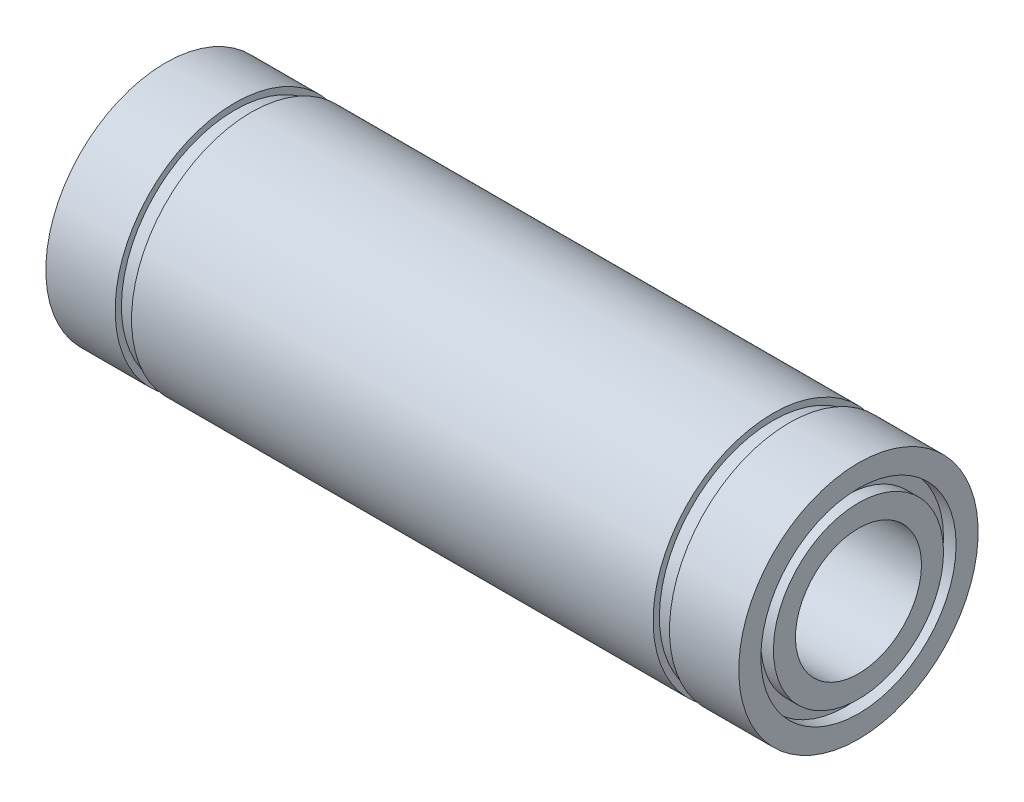
ISO-10303-21;
HEADER;
FILE_DESCRIPTION(('STEP AP214'),'2;1');
FILE_NAME('part.step','',(''),(''),'','','');
FILE_SCHEMA(('AUTOMOTIVE_DESIGN { 1 0 10303 214 1 1 1 1 }'));
ENDSEC;
DATA;
#1=APPLICATION_CONTEXT('core data for automotive mechanical design processes');
#2=APPLICATION_PROTOCOL_DEFINITION('international standard','automotive_design',2000,#1);
#3=PRODUCT_CONTEXT('',#1,'mechanical');
#4=PRODUCT('Part','Part','',(#3));
#5=PRODUCT_RELATED_PRODUCT_CATEGORY('part','',(#4));
#6=PRODUCT_DEFINITION_FORMATION('','',#4);
#7=PRODUCT_DEFINITION_CONTEXT('part definition',#1,'design');
#8=PRODUCT_DEFINITION('design','',#6,#7);
#9=PRODUCT_DEFINITION_SHAPE('','',#8);
#10=(LENGTH_UNIT() NAMED_UNIT(*) SI_UNIT(.MILLI.,.METRE.));
#11=(NAMED_UNIT(*) PLANE_ANGLE_UNIT() SI_UNIT($,.RADIAN.));
#12=(NAMED_UNIT(*) SI_UNIT($,.STERADIAN.) SOLID_ANGLE_UNIT());
#13=UNCERTAINTY_MEASURE_WITH_UNIT(LENGTH_MEASURE(1.E-05),#10,'distance_accuracy_value','');
#14=(GEOMETRIC_REPRESENTATION_CONTEXT(3) GLOBAL_UNCERTAINTY_ASSIGNED_CONTEXT((#13)) GLOBAL_UNIT_ASSIGNED_CONTEXT((#10,
#11,#12)) REPRESENTATION_CONTEXT('',''));
#15=CARTESIAN_POINT('',(0.,0.,0.));
#16=DIRECTION('',(0.,0.,1.));
#17=DIRECTION('',(1.,0.,0.));
#18=AXIS2_PLACEMENT_3D('',#15,#16,#17);
#19=CARTESIAN_POINT('',(-27.5,7.75,0.));
#20=DIRECTION('',(-1.,0.,0.));
#21=DIRECTION('',(0.,-1.,0.));
#22=AXIS2_PLACEMENT_3D('',#19,#20,#21);
#23=PLANE('',#22);
#24=CARTESIAN_POINT('',(-27.5,0.,0.));
#25=DIRECTION('',(1.,0.,0.));
#26=DIRECTION('',(0.,1.,0.));
#27=AXIS2_PLACEMENT_3D('',#24,#25,#26);
#28=CIRCLE('',#27,7.75);
#29=CARTESIAN_POINT('',(-27.5,7.75,0.));
#30=VERTEX_POINT('',#29);
#31=EDGE_CURVE('E123',#30,#30,#28,.T.);
#32=ORIENTED_EDGE('',*,*,#31,.T.);
#33=EDGE_LOOP('',(#32));
#34=FACE_BOUND('',#33,.T.);
#35=CARTESIAN_POINT('',(-27.5,0.,0.));
#36=DIRECTION('',(1.,0.,0.));
#37=DIRECTION('',(0.,1.,0.));
#38=AXIS2_PLACEMENT_3D('',#35,#36,#37);
#39=CIRCLE('',#38,9.5);
#40=CARTESIAN_POINT('',(-27.5,9.5,0.));
#41=VERTEX_POINT('',#40);
#42=EDGE_CURVE('E10',#41,#41,#39,.T.);
#43=ORIENTED_EDGE('',*,*,#42,.F.);
#44=EDGE_LOOP('',(#43));
#45=FACE_BOUND('',#44,.T.);
#46=ADVANCED_FACE('F40',(#34,#45),#23,.T.);
#47=CARTESIAN_POINT('',(0.,0.,0.));
#48=DIRECTION('',(1.,0.,0.));
#49=DIRECTION('',(0.,1.,0.));
#50=AXIS2_PLACEMENT_3D('',#47,#48,#49);
#51=CYLINDRICAL_SURFACE('',#50,9.5);
#52=ORIENTED_EDGE('',*,*,#42,.T.);
#53=EDGE_LOOP('',(#52));
#54=FACE_BOUND('',#53,.T.);
#55=CARTESIAN_POINT('',(-22.,0.,0.));
#56=DIRECTION('',(1.,0.,0.));
#57=DIRECTION('',(0.,1.,0.));
#58=AXIS2_PLACEMENT_3D('',#55,#56,#57);
#59=CIRCLE('',#58,9.5);
#60=CARTESIAN_POINT('',(-22.,9.5,0.));
#61=VERTEX_POINT('',#60);
#62=EDGE_CURVE('E47',#61,#61,#59,.T.);
#63=ORIENTED_EDGE('',*,*,#62,.F.);
#64=EDGE_LOOP('',(#63));
#65=FACE_BOUND('',#64,.T.);
#66=ADVANCED_FACE('F142',(#54,#65),#51,.T.);
#67=CARTESIAN_POINT('',(-22.,9.5,0.));
#68=DIRECTION('',(1.,0.,0.));
#69=DIRECTION('',(0.,1.,0.));
#70=AXIS2_PLACEMENT_3D('',#67,#68,#69);
#71=PLANE('',#70);
#72=ORIENTED_EDGE('',*,*,#62,.T.);
#73=EDGE_LOOP('',(#72));
#74=FACE_BOUND('',#73,.T.);
#75=CARTESIAN_POINT('',(-22.,0.,0.));
#76=DIRECTION('',(1.,0.,0.));
#77=DIRECTION('',(0.,1.,0.));
#78=AXIS2_PLACEMENT_3D('',#75,#76,#77);
#79=CIRCLE('',#78,9.);
#80=CARTESIAN_POINT('',(-22.,9.,0.));
#81=VERTEX_POINT('',#80);
#82=EDGE_CURVE('E54',#81,#81,#79,.T.);
#83=ORIENTED_EDGE('',*,*,#82,.F.);
#84=EDGE_LOOP('',(#83));
#85=FACE_BOUND('',#84,.T.);
#86=ADVANCED_FACE('F146',(#74,#85),#71,.T.);
#87=CARTESIAN_POINT('',(0.,0.,0.));
#88=DIRECTION('',(1.,0.,0.));
#89=DIRECTION('',(0.,1.,0.));
#90=AXIS2_PLACEMENT_3D('',#87,#88,#89);
#91=CYLINDRICAL_SURFACE('',#90,9.);
#92=ORIENTED_EDGE('',*,*,#82,.T.);
#93=EDGE_LOOP('',(#92));
#94=FACE_BOUND('',#93,.T.);
#95=CARTESIAN_POINT('',(-20.7,0.,0.));
#96=DIRECTION('',(1.,0.,0.));
#97=DIRECTION('',(0.,1.,0.));
#98=AXIS2_PLACEMENT_3D('',#95,#96,#97);
#99=CIRCLE('',#98,9.);
#100=CARTESIAN_POINT('',(-20.7,9.,0.));
#101=VERTEX_POINT('',#100);
#102=EDGE_CURVE('E61',#101,#101,#99,.T.);
#103=ORIENTED_EDGE('',*,*,#102,.F.);
#104=EDGE_LOOP('',(#103));
#105=FACE_BOUND('',#104,.T.);
#106=ADVANCED_FACE('F150',(#94,#105),#91,.T.);
#107=CARTESIAN_POINT('',(-20.7,9.,0.));
#108=DIRECTION('',(-1.,0.,0.));
#109=DIRECTION('',(0.,-1.,0.));
#110=AXIS2_PLACEMENT_3D('',#107,#108,#109);
#111=PLANE('',#110);
#112=ORIENTED_EDGE('',*,*,#102,.T.);
#113=EDGE_LOOP('',(#112));
#114=FACE_BOUND('',#113,.T.);
#115=CARTESIAN_POINT('',(-20.7,0.,0.));
#116=DIRECTION('',(1.,0.,0.));
#117=DIRECTION('',(0.,1.,0.));
#118=AXIS2_PLACEMENT_3D('',#115,#116,#117);
#119=CIRCLE('',#118,9.5);
#120=CARTESIAN_POINT('',(-20.7,9.5,0.));
#121=VERTEX_POINT('',#120);
#122=EDGE_CURVE('E67',#121,#121,#119,.T.);
#123=ORIENTED_EDGE('',*,*,#122,.F.);
#124=EDGE_LOOP('',(#123));
#125=FACE_BOUND('',#124,.T.);
#126=ADVANCED_FACE('F156',(#114,#125),#111,.T.);
#127=CARTESIAN_POINT('',(0.,0.,0.));
#128=DIRECTION('',(1.,0.,0.));
#129=DIRECTION('',(0.,1.,0.));
#130=AXIS2_PLACEMENT_3D('',#127,#128,#129);
#131=CYLINDRICAL_SURFACE('',#130,9.5);
#132=ORIENTED_EDGE('',*,*,#122,.T.);
#133=EDGE_LOOP('',(#132));
#134=FACE_BOUND('',#133,.T.);
#135=CARTESIAN_POINT('',(20.7,0.,0.));
#136=DIRECTION('',(1.,0.,0.));
#137=DIRECTION('',(0.,1.,0.));
#138=AXIS2_PLACEMENT_3D('',#135,#136,#137);
#139=CIRCLE('',#138,9.5);
#140=CARTESIAN_POINT('',(20.7,9.5,0.));
#141=VERTEX_POINT('',#140);
#142=EDGE_CURVE('E71',#141,#141,#139,.T.);
#143=ORIENTED_EDGE('',*,*,#142,.F.);
#144=EDGE_LOOP('',(#143));
#145=FACE_BOUND('',#144,.T.);
#146=ADVANCED_FACE('F160',(#134,#145),#131,.T.);
#147=CARTESIAN_POINT('',(20.7,9.5,0.));
#148=DIRECTION('',(1.,0.,0.));
#149=DIRECTION('',(0.,1.,0.));
#150=AXIS2_PLACEMENT_3D('',#147,#148,#149);
#151=PLANE('',#150);
#152=ORIENTED_EDGE('',*,*,#142,.T.);
#153=EDGE_LOOP('',(#152));
#154=FACE_BOUND('',#153,.T.);
#155=CARTESIAN_POINT('',(20.7,0.,0.));
#156=DIRECTION('',(1.,0.,0.));
#157=DIRECTION('',(0.,1.,0.));
#158=AXIS2_PLACEMENT_3D('',#155,#156,#157);
#159=CIRCLE('',#158,9.);
#160=CARTESIAN_POINT('',(20.7,9.,0.));
#161=VERTEX_POINT('',#160);
#162=EDGE_CURVE('E75',#161,#161,#159,.T.);
#163=ORIENTED_EDGE('',*,*,#162,.F.);
#164=EDGE_LOOP('',(#163));
#165=FACE_BOUND('',#164,.T.);
#166=ADVANCED_FACE('F164',(#154,#165),#151,.T.);
#167=CARTESIAN_POINT('',(0.,0.,0.));
#168=DIRECTION('',(1.,0.,0.));
#169=DIRECTION('',(0.,1.,0.));
#170=AXIS2_PLACEMENT_3D('',#167,#168,#169);
#171=CYLINDRICAL_SURFACE('',#170,9.);
#172=ORIENTED_EDGE('',*,*,#162,.T.);
#173=EDGE_LOOP('',(#172));
#174=FACE_BOUND('',#173,.T.);
#175=CARTESIAN_POINT('',(22.,0.,0.));
#176=DIRECTION('',(1.,0.,0.));
#177=DIRECTION('',(0.,1.,0.));
#178=AXIS2_PLACEMENT_3D('',#175,#176,#177);
#179=CIRCLE('',#178,9.);
#180=CARTESIAN_POINT('',(22.,9.,0.));
#181=VERTEX_POINT('',#180);
#182=EDGE_CURVE('E78',#181,#181,#179,.T.);
#183=ORIENTED_EDGE('',*,*,#182,.F.);
#184=EDGE_LOOP('',(#183));
#185=FACE_BOUND('',#184,.T.);
#186=ADVANCED_FACE('F168',(#174,#185),#171,.T.);
#187=CARTESIAN_POINT('',(22.,9.,0.));
#188=DIRECTION('',(-1.,0.,0.));
#189=DIRECTION('',(0.,-1.,0.));
#190=AXIS2_PLACEMENT_3D('',#187,#188,#189);
#191=PLANE('',#190);
#192=ORIENTED_EDGE('',*,*,#182,.T.);
#193=EDGE_LOOP('',(#192));
#194=FACE_BOUND('',#193,.T.);
#195=CARTESIAN_POINT('',(22.,0.,0.));
#196=DIRECTION('',(1.,0.,0.));
#197=DIRECTION('',(0.,1.,0.));
#198=AXIS2_PLACEMENT_3D('',#195,#196,#197);
#199=CIRCLE('',#198,9.5);
#200=CARTESIAN_POINT('',(22.,9.5,0.));
#201=VERTEX_POINT('',#200);
#202=EDGE_CURVE('E82',#201,#201,#199,.T.);
#203=ORIENTED_EDGE('',*,*,#202,.F.);
#204=EDGE_LOOP('',(#203));
#205=FACE_BOUND('',#204,.T.);
#206=ADVANCED_FACE('F172',(#194,#205),#191,.T.);
#207=CARTESIAN_POINT('',(0.,0.,0.));
#208=DIRECTION('',(1.,0.,0.));
#209=DIRECTION('',(0.,1.,0.));
#210=AXIS2_PLACEMENT_3D('',#207,#208,#209);
#211=CYLINDRICAL_SURFACE('',#210,9.49999999999999);
#212=ORIENTED_EDGE('',*,*,#202,.T.);
#213=EDGE_LOOP('',(#212));
#214=FACE_BOUND('',#213,.T.);
#215=CARTESIAN_POINT('',(27.5,0.,0.));
#216=DIRECTION('',(1.,0.,0.));
#217=DIRECTION('',(0.,1.,0.));
#218=AXIS2_PLACEMENT_3D('',#215,#216,#217);
#219=CIRCLE('',#218,9.49999999999999);
#220=CARTESIAN_POINT('',(27.5,9.49999999999999,0.));
#221=VERTEX_POINT('',#220);
#222=EDGE_CURVE('E86',#221,#221,#219,.T.);
#223=ORIENTED_EDGE('',*,*,#222,.F.);
#224=EDGE_LOOP('',(#223));
#225=FACE_BOUND('',#224,.T.);
#226=ADVANCED_FACE('F176',(#214,#225),#211,.T.);
#227=CARTESIAN_POINT('',(27.5,9.49999999999999,0.));
#228=DIRECTION('',(1.,0.,0.));
#229=DIRECTION('',(0.,1.,0.));
#230=AXIS2_PLACEMENT_3D('',#227,#228,#229);
#231=PLANE('',#230);
#232=ORIENTED_EDGE('',*,*,#222,.T.);
#233=EDGE_LOOP('',(#232));
#234=FACE_BOUND('',#233,.T.);
#235=CARTESIAN_POINT('',(27.5,0.,0.));
#236=DIRECTION('',(1.,0.,0.));
#237=DIRECTION('',(0.,1.,0.));
#238=AXIS2_PLACEMENT_3D('',#235,#236,#237);
#239=CIRCLE('',#238,7.74999999999999);
#240=CARTESIAN_POINT('',(27.5,7.74999999999999,0.));
#241=VERTEX_POINT('',#240);
#242=EDGE_CURVE('E89',#241,#241,#239,.T.);
#243=ORIENTED_EDGE('',*,*,#242,.F.);
#244=EDGE_LOOP('',(#243));
#245=FACE_BOUND('',#244,.T.);
#246=ADVANCED_FACE('F180',(#234,#245),#231,.T.);
#247=CARTESIAN_POINT('',(0.,0.,0.));
#248=DIRECTION('',(1.,0.,0.));
#249=DIRECTION('',(0.,1.,0.));
#250=AXIS2_PLACEMENT_3D('',#247,#248,#249);
#251=CYLINDRICAL_SURFACE('',#250,7.74999999999999);
#252=ORIENTED_EDGE('',*,*,#242,.T.);
#253=EDGE_LOOP('',(#252));
#254=FACE_BOUND('',#253,.T.);
#255=CARTESIAN_POINT('',(26.5,0.,0.));
#256=DIRECTION('',(1.,0.,0.));
#257=DIRECTION('',(0.,1.,0.));
#258=AXIS2_PLACEMENT_3D('',#255,#256,#257);
#259=CIRCLE('',#258,7.74999999999999);
#260=CARTESIAN_POINT('',(26.5,7.74999999999999,0.));
#261=VERTEX_POINT('',#260);
#262=EDGE_CURVE('E93',#261,#261,#259,.T.);
#263=ORIENTED_EDGE('',*,*,#262,.F.);
#264=EDGE_LOOP('',(#263));
#265=FACE_BOUND('',#264,.T.);
#266=ADVANCED_FACE('F184',(#254,#265),#251,.F.);
#267=CARTESIAN_POINT('',(26.5,7.74999999999999,0.));
#268=DIRECTION('',(1.,0.,0.));
#269=DIRECTION('',(0.,1.,0.));
#270=AXIS2_PLACEMENT_3D('',#267,#268,#269);
#271=PLANE('',#270);
#272=ORIENTED_EDGE('',*,*,#262,.T.);
#273=EDGE_LOOP('',(#272));
#274=FACE_BOUND('',#273,.T.);
#275=CARTESIAN_POINT('',(26.5,0.,0.));
#276=DIRECTION('',(1.,0.,0.));
#277=DIRECTION('',(0.,1.,0.));
#278=AXIS2_PLACEMENT_3D('',#275,#276,#277);
#279=CIRCLE('',#278,6.74999999999999);
#280=CARTESIAN_POINT('',(26.5,6.74999999999999,0.));
#281=VERTEX_POINT('',#280);
#282=EDGE_CURVE('E97',#281,#281,#279,.T.);
#283=ORIENTED_EDGE('',*,*,#282,.F.);
#284=EDGE_LOOP('',(#283));
#285=FACE_BOUND('',#284,.T.);
#286=ADVANCED_FACE('F188',(#274,#285),#271,.T.);
#287=CARTESIAN_POINT('',(0.,0.,0.));
#288=DIRECTION('',(1.,0.,0.));
#289=DIRECTION('',(0.,1.,0.));
#290=AXIS2_PLACEMENT_3D('',#287,#288,#289);
#291=CYLINDRICAL_SURFACE('',#290,6.74999999999999);
#292=ORIENTED_EDGE('',*,*,#282,.T.);
#293=EDGE_LOOP('',(#292));
#294=FACE_BOUND('',#293,.T.);
#295=CARTESIAN_POINT('',(27.5,0.,0.));
#296=DIRECTION('',(1.,0.,0.));
#297=DIRECTION('',(0.,1.,0.));
#298=AXIS2_PLACEMENT_3D('',#295,#296,#297);
#299=CIRCLE('',#298,6.74999999999999);
#300=CARTESIAN_POINT('',(27.5,6.74999999999999,0.));
#301=VERTEX_POINT('',#300);
#302=EDGE_CURVE('E101',#301,#301,#299,.T.);
#303=ORIENTED_EDGE('',*,*,#302,.F.);
#304=EDGE_LOOP('',(#303));
#305=FACE_BOUND('',#304,.T.);
#306=ADVANCED_FACE('F192',(#294,#305),#291,.T.);
#307=CARTESIAN_POINT('',(27.5,6.74999999999999,0.));
#308=DIRECTION('',(1.,0.,0.));
#309=DIRECTION('',(0.,1.,0.));
#310=AXIS2_PLACEMENT_3D('',#307,#308,#309);
#311=PLANE('',#310);
#312=ORIENTED_EDGE('',*,*,#302,.T.);
#313=EDGE_LOOP('',(#312));
#314=FACE_BOUND('',#313,.T.);
#315=CARTESIAN_POINT('',(27.5,0.,0.));
#316=DIRECTION('',(1.,0.,0.));
#317=DIRECTION('',(0.,1.,0.));
#318=AXIS2_PLACEMENT_3D('',#315,#316,#317);
#319=CIRCLE('',#318,4.99999999999999);
#320=CARTESIAN_POINT('',(27.5,5.,0.));
#321=VERTEX_POINT('',#320);
#322=EDGE_CURVE('E104',#321,#321,#319,.T.);
#323=ORIENTED_EDGE('',*,*,#322,.F.);
#324=EDGE_LOOP('',(#323));
#325=FACE_BOUND('',#324,.T.);
#326=ADVANCED_FACE('F196',(#314,#325),#311,.T.);
#327=CARTESIAN_POINT('',(0.,0.,0.));
#328=DIRECTION('',(1.,0.,0.));
#329=DIRECTION('',(0.,1.,0.));
#330=AXIS2_PLACEMENT_3D('',#327,#328,#329);
#331=CYLINDRICAL_SURFACE('',#330,5.);
#332=ORIENTED_EDGE('',*,*,#322,.T.);
#333=EDGE_LOOP('',(#332));
#334=FACE_BOUND('',#333,.T.);
#335=CARTESIAN_POINT('',(-27.5,0.,0.));
#336=DIRECTION('',(1.,0.,0.));
#337=DIRECTION('',(0.,1.,0.));
#338=AXIS2_PLACEMENT_3D('',#335,#336,#337);
#339=CIRCLE('',#338,5.);
#340=CARTESIAN_POINT('',(-27.5,5.,0.));
#341=VERTEX_POINT('',#340);
#342=EDGE_CURVE('E108',#341,#341,#339,.T.);
#343=ORIENTED_EDGE('',*,*,#342,.F.);
#344=EDGE_LOOP('',(#343));
#345=FACE_BOUND('',#344,.T.);
#346=ADVANCED_FACE('F200',(#334,#345),#331,.F.);
#347=CARTESIAN_POINT('',(-27.5,5.,0.));
#348=DIRECTION('',(-1.,0.,0.));
#349=DIRECTION('',(0.,-1.,0.));
#350=AXIS2_PLACEMENT_3D('',#347,#348,#349);
#351=PLANE('',#350);
#352=ORIENTED_EDGE('',*,*,#342,.T.);
#353=EDGE_LOOP('',(#352));
#354=FACE_BOUND('',#353,.T.);
#355=CARTESIAN_POINT('',(-27.5,0.,0.));
#356=DIRECTION('',(1.,0.,0.));
#357=DIRECTION('',(0.,1.,0.));
#358=AXIS2_PLACEMENT_3D('',#355,#356,#357);
#359=CIRCLE('',#358,6.75);
#360=CARTESIAN_POINT('',(-27.5,6.75,0.));
#361=VERTEX_POINT('',#360);
#362=EDGE_CURVE('E112',#361,#361,#359,.T.);
#363=ORIENTED_EDGE('',*,*,#362,.F.);
#364=EDGE_LOOP('',(#363));
#365=FACE_BOUND('',#364,.T.);
#366=ADVANCED_FACE('F204',(#354,#365),#351,.T.);
#367=CARTESIAN_POINT('',(0.,0.,0.));
#368=DIRECTION('',(1.,0.,0.));
#369=DIRECTION('',(0.,1.,0.));
#370=AXIS2_PLACEMENT_3D('',#367,#368,#369);
#371=CYLINDRICAL_SURFACE('',#370,6.75);
#372=ORIENTED_EDGE('',*,*,#362,.T.);
#373=EDGE_LOOP('',(#372));
#374=FACE_BOUND('',#373,.T.);
#375=CARTESIAN_POINT('',(-26.5,0.,0.));
#376=DIRECTION('',(1.,0.,0.));
#377=DIRECTION('',(0.,1.,0.));
#378=AXIS2_PLACEMENT_3D('',#375,#376,#377);
#379=CIRCLE('',#378,6.75);
#380=CARTESIAN_POINT('',(-26.5,6.75,0.));
#381=VERTEX_POINT('',#380);
#382=EDGE_CURVE('E116',#381,#381,#379,.T.);
#383=ORIENTED_EDGE('',*,*,#382,.F.);
#384=EDGE_LOOP('',(#383));
#385=FACE_BOUND('',#384,.T.);
#386=ADVANCED_FACE('F138',(#374,#385),#371,.T.);
#387=CARTESIAN_POINT('',(-26.5,7.75,0.));
#388=DIRECTION('',(-1.,0.,0.));
#389=DIRECTION('',(0.,-1.,0.));
#390=AXIS2_PLACEMENT_3D('',#387,#388,#389);
#391=PLANE('',#390);
#392=ORIENTED_EDGE('',*,*,#382,.T.);
#393=EDGE_LOOP('',(#392));
#394=FACE_BOUND('',#393,.T.);
#395=CARTESIAN_POINT('',(-26.5,0.,0.));
#396=DIRECTION('',(1.,0.,0.));
#397=DIRECTION('',(0.,1.,0.));
#398=AXIS2_PLACEMENT_3D('',#395,#396,#397);
#399=CIRCLE('',#398,7.75);
#400=CARTESIAN_POINT('',(-26.5,7.75,0.));
#401=VERTEX_POINT('',#400);
#402=EDGE_CURVE('E119',#401,#401,#399,.T.);
#403=ORIENTED_EDGE('',*,*,#402,.F.);
#404=EDGE_LOOP('',(#403));
#405=FACE_BOUND('',#404,.T.);
#406=ADVANCED_FACE('F132',(#394,#405),#391,.T.);
#407=CARTESIAN_POINT('',(0.,0.,0.));
#408=DIRECTION('',(1.,0.,0.));
#409=DIRECTION('',(0.,1.,0.));
#410=AXIS2_PLACEMENT_3D('',#407,#408,#409);
#411=CYLINDRICAL_SURFACE('',#410,7.75);
#412=ORIENTED_EDGE('',*,*,#402,.T.);
#413=EDGE_LOOP('',(#412));
#414=FACE_BOUND('',#413,.T.);
#415=ORIENTED_EDGE('',*,*,#31,.F.);
#416=EDGE_LOOP('',(#415));
#417=FACE_BOUND('',#416,.T.);
#418=ADVANCED_FACE('F130',(#414,#417),#411,.F.);
#419=CLOSED_SHELL('',(#46,#66,#86,#106,#126,#146,#166,#186,#206,#226,#246,#266,#286,#306,#326,
#346,#366,#386,#406,#418));
#420=MANIFOLD_SOLID_BREP('B2',#419);
#421=ADVANCED_BREP_SHAPE_REPRESENTATION('',(#18,#420),#14);
#422=SHAPE_DEFINITION_REPRESENTATION(#9,#421);
ENDSEC;
END-ISO-10303-21;
